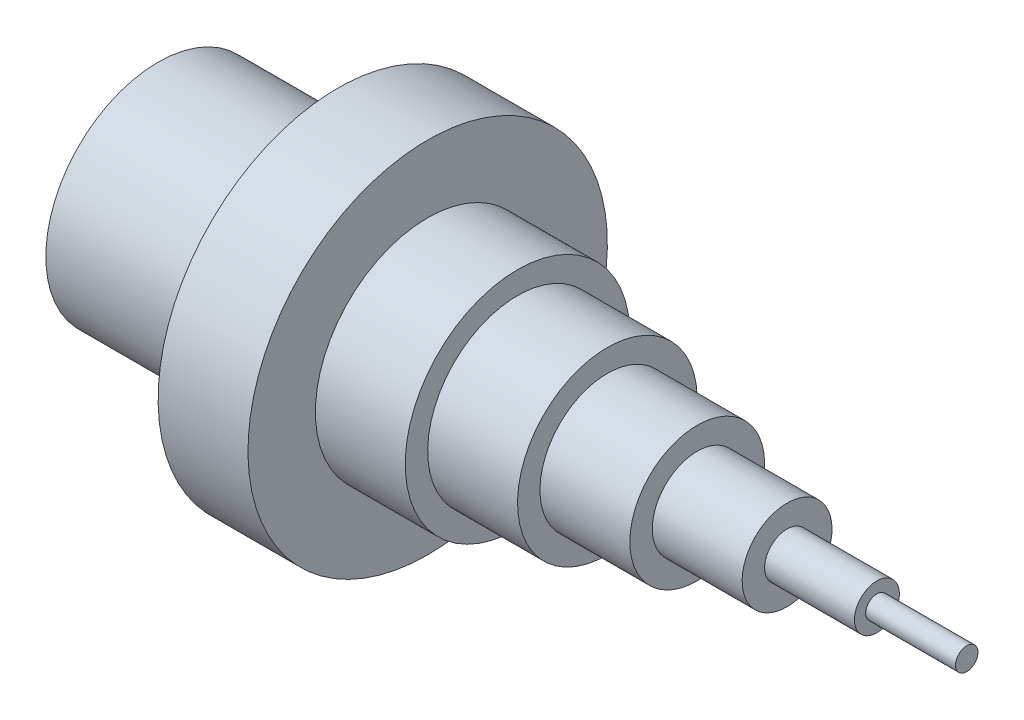
ISO-10303-21;
HEADER;
FILE_DESCRIPTION(('STEP AP214'),'2;1');
FILE_NAME('part.step','',(''),(''),'','','');
FILE_SCHEMA(('AUTOMOTIVE_DESIGN { 1 0 10303 214 1 1 1 1 }'));
ENDSEC;
DATA;
#1=APPLICATION_CONTEXT('core data for automotive mechanical design processes');
#2=APPLICATION_PROTOCOL_DEFINITION('international standard','automotive_design',2000,#1);
#3=PRODUCT_CONTEXT('',#1,'mechanical');
#4=PRODUCT('Part','Part','',(#3));
#5=PRODUCT_RELATED_PRODUCT_CATEGORY('part','',(#4));
#6=PRODUCT_DEFINITION_FORMATION('','',#4);
#7=PRODUCT_DEFINITION_CONTEXT('part definition',#1,'design');
#8=PRODUCT_DEFINITION('design','',#6,#7);
#9=PRODUCT_DEFINITION_SHAPE('','',#8);
#10=(LENGTH_UNIT() NAMED_UNIT(*) SI_UNIT(.MILLI.,.METRE.));
#11=(NAMED_UNIT(*) PLANE_ANGLE_UNIT() SI_UNIT($,.RADIAN.));
#12=(NAMED_UNIT(*) SI_UNIT($,.STERADIAN.) SOLID_ANGLE_UNIT());
#13=UNCERTAINTY_MEASURE_WITH_UNIT(LENGTH_MEASURE(1.E-05),#10,'distance_accuracy_value','');
#14=(GEOMETRIC_REPRESENTATION_CONTEXT(3) GLOBAL_UNCERTAINTY_ASSIGNED_CONTEXT((#13)) GLOBAL_UNIT_ASSIGNED_CONTEXT((#10,
#11,#12)) REPRESENTATION_CONTEXT('',''));
#15=CARTESIAN_POINT('',(0.,0.,0.));
#16=DIRECTION('',(0.,0.,1.));
#17=DIRECTION('',(1.,0.,0.));
#18=AXIS2_PLACEMENT_3D('',#15,#16,#17);
#19=CARTESIAN_POINT('',(0.,0.,0.));
#20=DIRECTION('',(-1.,0.,0.));
#21=DIRECTION('',(0.,-1.,0.));
#22=AXIS2_PLACEMENT_3D('',#19,#20,#21);
#23=CYLINDRICAL_SURFACE('',#22,25.);
#24=CARTESIAN_POINT('',(60.,0.,0.));
#25=DIRECTION('',(-1.,0.,0.));
#26=DIRECTION('',(0.,-1.,0.));
#27=AXIS2_PLACEMENT_3D('',#24,#25,#26);
#28=CIRCLE('',#27,25.);
#29=CARTESIAN_POINT('',(60.,-25.,0.));
#30=VERTEX_POINT('',#29);
#31=EDGE_CURVE('E83',#30,#30,#28,.T.);
#32=ORIENTED_EDGE('',*,*,#31,.F.);
#33=EDGE_LOOP('',(#32));
#34=FACE_BOUND('',#33,.T.);
#35=CARTESIAN_POINT('',(80.,0.,0.));
#36=DIRECTION('',(-1.,0.,0.));
#37=DIRECTION('',(0.,-1.,0.));
#38=AXIS2_PLACEMENT_3D('',#35,#36,#37);
#39=CIRCLE('',#38,25.);
#40=CARTESIAN_POINT('',(80.,-25.,0.));
#41=VERTEX_POINT('',#40);
#42=EDGE_CURVE('E10',#41,#41,#39,.T.);
#43=ORIENTED_EDGE('',*,*,#42,.T.);
#44=EDGE_LOOP('',(#43));
#45=FACE_BOUND('',#44,.T.);
#46=ADVANCED_FACE('F31',(#34,#45),#23,.T.);
#47=CARTESIAN_POINT('',(80.,25.,0.));
#48=DIRECTION('',(-1.,0.,0.));
#49=DIRECTION('',(0.,-1.,0.));
#50=AXIS2_PLACEMENT_3D('',#47,#48,#49);
#51=PLANE('',#50);
#52=ORIENTED_EDGE('',*,*,#42,.F.);
#53=EDGE_LOOP('',(#52));
#54=FACE_BOUND('',#53,.T.);
#55=CARTESIAN_POINT('',(80.,0.,0.));
#56=DIRECTION('',(-1.,0.,0.));
#57=DIRECTION('',(0.,-1.,0.));
#58=AXIS2_PLACEMENT_3D('',#55,#56,#57);
#59=CIRCLE('',#58,20.);
#60=CARTESIAN_POINT('',(80.,-20.,0.));
#61=VERTEX_POINT('',#60);
#62=EDGE_CURVE('E37',#61,#61,#59,.T.);
#63=ORIENTED_EDGE('',*,*,#62,.T.);
#64=EDGE_LOOP('',(#63));
#65=FACE_BOUND('',#64,.T.);
#66=ADVANCED_FACE('F133',(#54,#65),#51,.F.);
#67=CARTESIAN_POINT('',(0.,0.,0.));
#68=DIRECTION('',(-1.,0.,0.));
#69=DIRECTION('',(0.,-1.,0.));
#70=AXIS2_PLACEMENT_3D('',#67,#68,#69);
#71=CYLINDRICAL_SURFACE('',#70,20.);
#72=ORIENTED_EDGE('',*,*,#62,.F.);
#73=EDGE_LOOP('',(#72));
#74=FACE_BOUND('',#73,.T.);
#75=CARTESIAN_POINT('',(100.,0.,0.));
#76=DIRECTION('',(-1.,0.,0.));
#77=DIRECTION('',(0.,-1.,0.));
#78=AXIS2_PLACEMENT_3D('',#75,#76,#77);
#79=CIRCLE('',#78,20.);
#80=CARTESIAN_POINT('',(100.,-20.,0.));
#81=VERTEX_POINT('',#80);
#82=EDGE_CURVE('E41',#81,#81,#79,.T.);
#83=ORIENTED_EDGE('',*,*,#82,.T.);
#84=EDGE_LOOP('',(#83));
#85=FACE_BOUND('',#84,.T.);
#86=ADVANCED_FACE('F137',(#74,#85),#71,.T.);
#87=CARTESIAN_POINT('',(100.,20.,0.));
#88=DIRECTION('',(-1.,0.,0.));
#89=DIRECTION('',(0.,-1.,0.));
#90=AXIS2_PLACEMENT_3D('',#87,#88,#89);
#91=PLANE('',#90);
#92=ORIENTED_EDGE('',*,*,#82,.F.);
#93=EDGE_LOOP('',(#92));
#94=FACE_BOUND('',#93,.T.);
#95=CARTESIAN_POINT('',(100.,0.,0.));
#96=DIRECTION('',(-1.,0.,0.));
#97=DIRECTION('',(0.,-1.,0.));
#98=AXIS2_PLACEMENT_3D('',#95,#96,#97);
#99=CIRCLE('',#98,15.);
#100=CARTESIAN_POINT('',(100.,-15.,0.));
#101=VERTEX_POINT('',#100);
#102=EDGE_CURVE('E45',#101,#101,#99,.T.);
#103=ORIENTED_EDGE('',*,*,#102,.T.);
#104=EDGE_LOOP('',(#103));
#105=FACE_BOUND('',#104,.T.);
#106=ADVANCED_FACE('F142',(#94,#105),#91,.F.);
#107=CARTESIAN_POINT('',(0.,0.,0.));
#108=DIRECTION('',(-1.,0.,0.));
#109=DIRECTION('',(0.,-1.,0.));
#110=AXIS2_PLACEMENT_3D('',#107,#108,#109);
#111=CYLINDRICAL_SURFACE('',#110,15.);
#112=ORIENTED_EDGE('',*,*,#102,.F.);
#113=EDGE_LOOP('',(#112));
#114=FACE_BOUND('',#113,.T.);
#115=CARTESIAN_POINT('',(120.,0.,0.));
#116=DIRECTION('',(-1.,0.,0.));
#117=DIRECTION('',(0.,-1.,0.));
#118=AXIS2_PLACEMENT_3D('',#115,#116,#117);
#119=CIRCLE('',#118,15.);
#120=CARTESIAN_POINT('',(120.,-15.,0.));
#121=VERTEX_POINT('',#120);
#122=EDGE_CURVE('E50',#121,#121,#119,.T.);
#123=ORIENTED_EDGE('',*,*,#122,.T.);
#124=EDGE_LOOP('',(#123));
#125=FACE_BOUND('',#124,.T.);
#126=ADVANCED_FACE('F148',(#114,#125),#111,.T.);
#127=CARTESIAN_POINT('',(120.,15.,0.));
#128=DIRECTION('',(-1.,0.,0.));
#129=DIRECTION('',(0.,-1.,0.));
#130=AXIS2_PLACEMENT_3D('',#127,#128,#129);
#131=PLANE('',#130);
#132=ORIENTED_EDGE('',*,*,#122,.F.);
#133=EDGE_LOOP('',(#132));
#134=FACE_BOUND('',#133,.T.);
#135=CARTESIAN_POINT('',(120.,0.,0.));
#136=DIRECTION('',(-1.,0.,0.));
#137=DIRECTION('',(0.,-1.,0.));
#138=AXIS2_PLACEMENT_3D('',#135,#136,#137);
#139=CIRCLE('',#138,9.99999999999998);
#140=CARTESIAN_POINT('',(120.,-9.99999999999999,0.));
#141=VERTEX_POINT('',#140);
#142=EDGE_CURVE('E53',#141,#141,#139,.T.);
#143=ORIENTED_EDGE('',*,*,#142,.T.);
#144=EDGE_LOOP('',(#143));
#145=FACE_BOUND('',#144,.T.);
#146=ADVANCED_FACE('F152',(#134,#145),#131,.F.);
#147=CARTESIAN_POINT('',(0.,0.,0.));
#148=DIRECTION('',(-1.,0.,0.));
#149=DIRECTION('',(0.,-1.,0.));
#150=AXIS2_PLACEMENT_3D('',#147,#148,#149);
#151=CYLINDRICAL_SURFACE('',#150,9.99999999999998);
#152=ORIENTED_EDGE('',*,*,#142,.F.);
#153=EDGE_LOOP('',(#152));
#154=FACE_BOUND('',#153,.T.);
#155=CARTESIAN_POINT('',(140.,0.,0.));
#156=DIRECTION('',(-1.,0.,0.));
#157=DIRECTION('',(0.,-1.,0.));
#158=AXIS2_PLACEMENT_3D('',#155,#156,#157);
#159=CIRCLE('',#158,9.99999999999998);
#160=CARTESIAN_POINT('',(140.,-9.99999999999999,0.));
#161=VERTEX_POINT('',#160);
#162=EDGE_CURVE('E56',#161,#161,#159,.T.);
#163=ORIENTED_EDGE('',*,*,#162,.T.);
#164=EDGE_LOOP('',(#163));
#165=FACE_BOUND('',#164,.T.);
#166=ADVANCED_FACE('F156',(#154,#165),#151,.T.);
#167=CARTESIAN_POINT('',(140.,9.99999999999997,0.));
#168=DIRECTION('',(-1.,0.,0.));
#169=DIRECTION('',(0.,-1.,0.));
#170=AXIS2_PLACEMENT_3D('',#167,#168,#169);
#171=PLANE('',#170);
#172=ORIENTED_EDGE('',*,*,#162,.F.);
#173=EDGE_LOOP('',(#172));
#174=FACE_BOUND('',#173,.T.);
#175=CARTESIAN_POINT('',(140.,0.,0.));
#176=DIRECTION('',(-1.,0.,0.));
#177=DIRECTION('',(0.,-1.,0.));
#178=AXIS2_PLACEMENT_3D('',#175,#176,#177);
#179=CIRCLE('',#178,4.99999999999999);
#180=CARTESIAN_POINT('',(140.,-5.,0.));
#181=VERTEX_POINT('',#180);
#182=EDGE_CURVE('E59',#181,#181,#179,.T.);
#183=ORIENTED_EDGE('',*,*,#182,.T.);
#184=EDGE_LOOP('',(#183));
#185=FACE_BOUND('',#184,.T.);
#186=ADVANCED_FACE('F160',(#174,#185),#171,.F.);
#187=CARTESIAN_POINT('',(0.,0.,0.));
#188=DIRECTION('',(-1.,0.,0.));
#189=DIRECTION('',(0.,-1.,0.));
#190=AXIS2_PLACEMENT_3D('',#187,#188,#189);
#191=CYLINDRICAL_SURFACE('',#190,4.99999999999999);
#192=ORIENTED_EDGE('',*,*,#182,.F.);
#193=EDGE_LOOP('',(#192));
#194=FACE_BOUND('',#193,.T.);
#195=CARTESIAN_POINT('',(160.,0.,0.));
#196=DIRECTION('',(-1.,0.,0.));
#197=DIRECTION('',(0.,-1.,0.));
#198=AXIS2_PLACEMENT_3D('',#195,#196,#197);
#199=CIRCLE('',#198,4.99999999999999);
#200=CARTESIAN_POINT('',(160.,-5.,0.));
#201=VERTEX_POINT('',#200);
#202=EDGE_CURVE('E62',#201,#201,#199,.T.);
#203=ORIENTED_EDGE('',*,*,#202,.T.);
#204=EDGE_LOOP('',(#203));
#205=FACE_BOUND('',#204,.T.);
#206=ADVANCED_FACE('F164',(#194,#205),#191,.T.);
#207=CARTESIAN_POINT('',(160.,4.99999999999998,0.));
#208=DIRECTION('',(-1.,0.,0.));
#209=DIRECTION('',(0.,-1.,0.));
#210=AXIS2_PLACEMENT_3D('',#207,#208,#209);
#211=PLANE('',#210);
#212=ORIENTED_EDGE('',*,*,#202,.F.);
#213=EDGE_LOOP('',(#212));
#214=FACE_BOUND('',#213,.T.);
#215=CARTESIAN_POINT('',(160.,0.,0.));
#216=DIRECTION('',(-1.,0.,0.));
#217=DIRECTION('',(0.,-1.,0.));
#218=AXIS2_PLACEMENT_3D('',#215,#216,#217);
#219=CIRCLE('',#218,2.5);
#220=CARTESIAN_POINT('',(160.,-2.50000000000001,0.));
#221=VERTEX_POINT('',#220);
#222=EDGE_CURVE('E65',#221,#221,#219,.T.);
#223=ORIENTED_EDGE('',*,*,#222,.T.);
#224=EDGE_LOOP('',(#223));
#225=FACE_BOUND('',#224,.T.);
#226=ADVANCED_FACE('F168',(#214,#225),#211,.F.);
#227=CARTESIAN_POINT('',(0.,0.,0.));
#228=DIRECTION('',(-1.,0.,0.));
#229=DIRECTION('',(0.,-1.,0.));
#230=AXIS2_PLACEMENT_3D('',#227,#228,#229);
#231=CYLINDRICAL_SURFACE('',#230,2.5);
#232=ORIENTED_EDGE('',*,*,#222,.F.);
#233=EDGE_LOOP('',(#232));
#234=FACE_BOUND('',#233,.T.);
#235=CARTESIAN_POINT('',(180.,0.,0.));
#236=DIRECTION('',(-1.,0.,0.));
#237=DIRECTION('',(0.,-1.,0.));
#238=AXIS2_PLACEMENT_3D('',#235,#236,#237);
#239=CIRCLE('',#238,2.5);
#240=CARTESIAN_POINT('',(180.,-2.50000000000001,0.));
#241=VERTEX_POINT('',#240);
#242=EDGE_CURVE('E68',#241,#241,#239,.T.);
#243=ORIENTED_EDGE('',*,*,#242,.T.);
#244=EDGE_LOOP('',(#243));
#245=FACE_BOUND('',#244,.T.);
#246=ADVANCED_FACE('F172',(#234,#245),#231,.T.);
#247=CARTESIAN_POINT('',(180.,2.49999999999999,0.));
#248=DIRECTION('',(-1.,0.,0.));
#249=DIRECTION('',(0.,-1.,0.));
#250=AXIS2_PLACEMENT_3D('',#247,#248,#249);
#251=PLANE('',#250);
#252=ORIENTED_EDGE('',*,*,#242,.F.);
#253=EDGE_LOOP('',(#252));
#254=FACE_BOUND('',#253,.T.);
#255=ADVANCED_FACE('F106',(#254),#251,.F.);
#256=CARTESIAN_POINT('',(0.,0.,0.));
#257=DIRECTION('',(1.,0.,0.));
#258=DIRECTION('',(0.,1.,0.));
#259=AXIS2_PLACEMENT_3D('',#256,#257,#258);
#260=PLANE('',#259);
#261=CARTESIAN_POINT('',(0.,0.,0.));
#262=DIRECTION('',(-1.,0.,0.));
#263=DIRECTION('',(0.,-1.,0.));
#264=AXIS2_PLACEMENT_3D('',#261,#262,#263);
#265=CIRCLE('',#264,20.);
#266=CARTESIAN_POINT('',(0.,-20.,0.));
#267=VERTEX_POINT('',#266);
#268=EDGE_CURVE('E87',#267,#267,#265,.T.);
#269=ORIENTED_EDGE('',*,*,#268,.F.);
#270=EDGE_LOOP('',(#269));
#271=FACE_BOUND('',#270,.T.);
#272=CARTESIAN_POINT('',(0.,0.,0.));
#273=DIRECTION('',(-1.,0.,0.));
#274=DIRECTION('',(0.,-1.,0.));
#275=AXIS2_PLACEMENT_3D('',#272,#273,#274);
#276=CIRCLE('',#275,25.);
#277=CARTESIAN_POINT('',(0.,-25.,0.));
#278=VERTEX_POINT('',#277);
#279=EDGE_CURVE('E71',#278,#278,#276,.T.);
#280=ORIENTED_EDGE('',*,*,#279,.T.);
#281=EDGE_LOOP('',(#280));
#282=FACE_BOUND('',#281,.T.);
#283=ADVANCED_FACE('F102',(#271,#282),#260,.F.);
#284=CARTESIAN_POINT('',(0.,0.,0.));
#285=DIRECTION('',(-1.,0.,0.));
#286=DIRECTION('',(0.,-1.,0.));
#287=AXIS2_PLACEMENT_3D('',#284,#285,#286);
#288=CYLINDRICAL_SURFACE('',#287,25.);
#289=ORIENTED_EDGE('',*,*,#279,.F.);
#290=EDGE_LOOP('',(#289));
#291=FACE_BOUND('',#290,.T.);
#292=CARTESIAN_POINT('',(40.,0.,0.));
#293=DIRECTION('',(-1.,0.,0.));
#294=DIRECTION('',(0.,-1.,0.));
#295=AXIS2_PLACEMENT_3D('',#292,#293,#294);
#296=CIRCLE('',#295,25.);
#297=CARTESIAN_POINT('',(40.,-25.,0.));
#298=VERTEX_POINT('',#297);
#299=EDGE_CURVE('E74',#298,#298,#296,.T.);
#300=ORIENTED_EDGE('',*,*,#299,.T.);
#301=EDGE_LOOP('',(#300));
#302=FACE_BOUND('',#301,.T.);
#303=ADVANCED_FACE('F105',(#291,#302),#288,.T.);
#304=CARTESIAN_POINT('',(40.,25.,0.));
#305=DIRECTION('',(1.,0.,0.));
#306=DIRECTION('',(0.,1.,0.));
#307=AXIS2_PLACEMENT_3D('',#304,#305,#306);
#308=PLANE('',#307);
#309=ORIENTED_EDGE('',*,*,#299,.F.);
#310=EDGE_LOOP('',(#309));
#311=FACE_BOUND('',#310,.T.);
#312=CARTESIAN_POINT('',(40.,0.,0.));
#313=DIRECTION('',(-1.,0.,0.));
#314=DIRECTION('',(0.,-1.,0.));
#315=AXIS2_PLACEMENT_3D('',#312,#313,#314);
#316=CIRCLE('',#315,40.);
#317=CARTESIAN_POINT('',(40.,-40.,0.));
#318=VERTEX_POINT('',#317);
#319=EDGE_CURVE('E77',#318,#318,#316,.T.);
#320=ORIENTED_EDGE('',*,*,#319,.T.);
#321=EDGE_LOOP('',(#320));
#322=FACE_BOUND('',#321,.T.);
#323=ADVANCED_FACE('F112',(#311,#322),#308,.F.);
#324=CARTESIAN_POINT('',(0.,0.,0.));
#325=DIRECTION('',(-1.,0.,0.));
#326=DIRECTION('',(0.,-1.,0.));
#327=AXIS2_PLACEMENT_3D('',#324,#325,#326);
#328=CYLINDRICAL_SURFACE('',#327,40.);
#329=ORIENTED_EDGE('',*,*,#319,.F.);
#330=EDGE_LOOP('',(#329));
#331=FACE_BOUND('',#330,.T.);
#332=CARTESIAN_POINT('',(60.,0.,0.));
#333=DIRECTION('',(-1.,0.,0.));
#334=DIRECTION('',(0.,-1.,0.));
#335=AXIS2_PLACEMENT_3D('',#332,#333,#334);
#336=CIRCLE('',#335,40.);
#337=CARTESIAN_POINT('',(60.,-40.,0.));
#338=VERTEX_POINT('',#337);
#339=EDGE_CURVE('E80',#338,#338,#336,.T.);
#340=ORIENTED_EDGE('',*,*,#339,.T.);
#341=EDGE_LOOP('',(#340));
#342=FACE_BOUND('',#341,.T.);
#343=ADVANCED_FACE('F118',(#331,#342),#328,.T.);
#344=CARTESIAN_POINT('',(60.,40.,0.));
#345=DIRECTION('',(-1.,0.,0.));
#346=DIRECTION('',(0.,-1.,0.));
#347=AXIS2_PLACEMENT_3D('',#344,#345,#346);
#348=PLANE('',#347);
#349=ORIENTED_EDGE('',*,*,#339,.F.);
#350=EDGE_LOOP('',(#349));
#351=FACE_BOUND('',#350,.T.);
#352=ORIENTED_EDGE('',*,*,#31,.T.);
#353=EDGE_LOOP('',(#352));
#354=FACE_BOUND('',#353,.T.);
#355=ADVANCED_FACE('F98',(#351,#354),#348,.F.);
#356=CARTESIAN_POINT('',(40.,0.,0.));
#357=DIRECTION('',(-1.,0.,0.));
#358=DIRECTION('',(0.,-1.,0.));
#359=AXIS2_PLACEMENT_3D('',#356,#357,#358);
#360=CYLINDRICAL_SURFACE('',#359,20.);
#361=CARTESIAN_POINT('',(40.,0.,0.));
#362=DIRECTION('',(-1.,0.,0.));
#363=DIRECTION('',(0.,-1.,0.));
#364=AXIS2_PLACEMENT_3D('',#361,#362,#363);
#365=CIRCLE('',#364,20.);
#366=CARTESIAN_POINT('',(40.,-20.,0.));
#367=VERTEX_POINT('',#366);
#368=EDGE_CURVE('E86',#367,#367,#365,.T.);
#369=ORIENTED_EDGE('',*,*,#368,.F.);
#370=EDGE_LOOP('',(#369));
#371=FACE_BOUND('',#370,.T.);
#372=ORIENTED_EDGE('',*,*,#268,.T.);
#373=EDGE_LOOP('',(#372));
#374=FACE_BOUND('',#373,.T.);
#375=ADVANCED_FACE('F95',(#371,#374),#360,.F.);
#376=CARTESIAN_POINT('',(40.,0.,0.));
#377=DIRECTION('',(-1.,0.,0.));
#378=DIRECTION('',(0.,-1.,0.));
#379=AXIS2_PLACEMENT_3D('',#376,#377,#378);
#380=PLANE('',#379);
#381=ORIENTED_EDGE('',*,*,#368,.T.);
#382=EDGE_LOOP('',(#381));
#383=FACE_BOUND('',#382,.T.);
#384=ADVANCED_FACE('F93',(#383),#380,.T.);
#385=CLOSED_SHELL('',(#46,#66,#86,#106,#126,#146,#166,#186,#206,#226,#246,#255,#283,#303,#323,
#343,#355,#375,#384));
#386=MANIFOLD_SOLID_BREP('B2',#385);
#387=ADVANCED_BREP_SHAPE_REPRESENTATION('',(#18,#386),#14);
#388=SHAPE_DEFINITION_REPRESENTATION(#9,#387);
ENDSEC;
END-ISO-10303-21;
